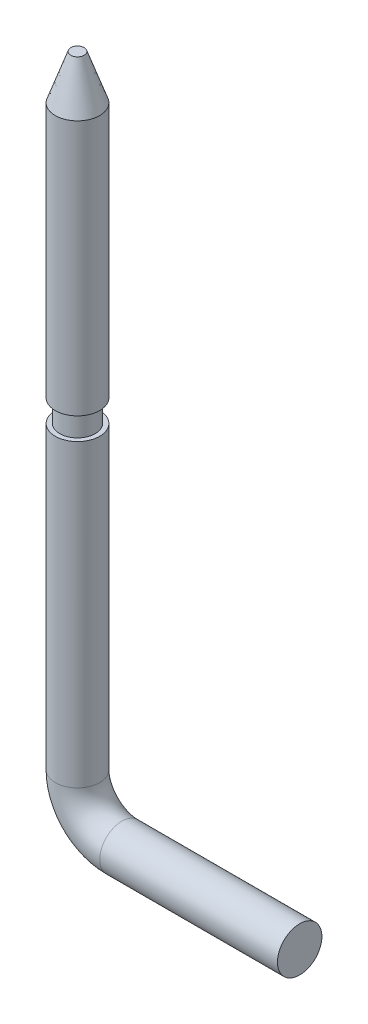
ISO-10303-21;
HEADER;
FILE_DESCRIPTION(('STEP AP214'),'2;1');
FILE_NAME('part.step','',(''),(''),'','','');
FILE_SCHEMA(('AUTOMOTIVE_DESIGN { 1 0 10303 214 1 1 1 1 }'));
ENDSEC;
DATA;
#1=APPLICATION_CONTEXT('core data for automotive mechanical design processes');
#2=APPLICATION_PROTOCOL_DEFINITION('international standard','automotive_design',2000,#1);
#3=PRODUCT_CONTEXT('',#1,'mechanical');
#4=PRODUCT('Part','Part','',(#3));
#5=PRODUCT_RELATED_PRODUCT_CATEGORY('part','',(#4));
#6=PRODUCT_DEFINITION_FORMATION('','',#4);
#7=PRODUCT_DEFINITION_CONTEXT('part definition',#1,'design');
#8=PRODUCT_DEFINITION('design','',#6,#7);
#9=PRODUCT_DEFINITION_SHAPE('','',#8);
#10=(LENGTH_UNIT() NAMED_UNIT(*) SI_UNIT(.MILLI.,.METRE.));
#11=(NAMED_UNIT(*) PLANE_ANGLE_UNIT() SI_UNIT($,.RADIAN.));
#12=(NAMED_UNIT(*) SI_UNIT($,.STERADIAN.) SOLID_ANGLE_UNIT());
#13=UNCERTAINTY_MEASURE_WITH_UNIT(LENGTH_MEASURE(1.E-05),#10,'distance_accuracy_value','');
#14=(GEOMETRIC_REPRESENTATION_CONTEXT(3) GLOBAL_UNCERTAINTY_ASSIGNED_CONTEXT((#13)) GLOBAL_UNIT_ASSIGNED_CONTEXT((#10,
#11,#12)) REPRESENTATION_CONTEXT('',''));
#15=CARTESIAN_POINT('',(0.,0.,0.));
#16=DIRECTION('',(0.,0.,1.));
#17=DIRECTION('',(1.,0.,0.));
#18=AXIS2_PLACEMENT_3D('',#15,#16,#17);
#19=CARTESIAN_POINT('',(0.,2.00000000000001,0.));
#20=DIRECTION('',(0.,1.,0.));
#21=DIRECTION('',(-1.,0.,0.));
#22=AXIS2_PLACEMENT_3D('',#19,#20,#21);
#23=CYLINDRICAL_SURFACE('',#22,1.);
#24=CARTESIAN_POINT('',(0.,15.5,0.));
#25=DIRECTION('',(0.,1.,0.));
#26=DIRECTION('',(0.,0.,1.));
#27=AXIS2_PLACEMENT_3D('',#24,#25,#26);
#28=CIRCLE('',#27,1.);
#29=CARTESIAN_POINT('',(0.,15.5,1.));
#30=VERTEX_POINT('',#29);
#31=EDGE_CURVE('E53',#30,#30,#28,.T.);
#32=ORIENTED_EDGE('',*,*,#31,.F.);
#33=EDGE_LOOP('',(#32));
#34=FACE_BOUND('',#33,.T.);
#35=CARTESIAN_POINT('',(0.,2.00000000000001,0.));
#36=DIRECTION('',(0.,-1.,0.));
#37=DIRECTION('',(0.,0.,-1.));
#38=AXIS2_PLACEMENT_3D('',#35,#36,#37);
#39=CIRCLE('',#38,1.);
#40=CARTESIAN_POINT('',(-1.,2.00000000000002,0.));
#41=VERTEX_POINT('',#40);
#42=EDGE_CURVE('E10',#41,#41,#39,.T.);
#43=ORIENTED_EDGE('',*,*,#42,.F.);
#44=EDGE_LOOP('',(#43));
#45=FACE_BOUND('',#44,.T.);
#46=ADVANCED_FACE('F30',(#34,#45),#23,.T.);
#47=CARTESIAN_POINT('',(2.,2.,0.));
#48=DIRECTION('',(0.,0.,-1.));
#49=DIRECTION('',(-1.,0.,0.));
#50=AXIS2_PLACEMENT_3D('',#47,#48,#49);
#51=TOROIDAL_SURFACE('',#50,2.,1.);
#52=CARTESIAN_POINT('',(2.00000000000001,0.,0.));
#53=DIRECTION('',(1.,0.,0.));
#54=DIRECTION('',(0.,0.,-1.));
#55=AXIS2_PLACEMENT_3D('',#52,#53,#54);
#56=CIRCLE('',#55,1.);
#57=CARTESIAN_POINT('',(2.00000000000002,-1.,0.));
#58=VERTEX_POINT('',#57);
#59=EDGE_CURVE('E37',#58,#58,#56,.T.);
#60=CARTESIAN_POINT('',(2.,2.,0.));
#61=DIRECTION('',(0.,0.,-1.));
#62=DIRECTION('',(-1.,0.,0.));
#63=AXIS2_PLACEMENT_3D('',#60,#61,#62);
#64=CIRCLE('',#63,3.);
#65=EDGE_CURVE('',#58,#41,#64,.T.);
#66=ORIENTED_EDGE('',*,*,#59,.F.);
#67=ORIENTED_EDGE('',*,*,#42,.T.);
#68=ORIENTED_EDGE('',*,*,#65,.T.);
#69=ORIENTED_EDGE('',*,*,#65,.F.);
#70=EDGE_LOOP('',(#66,#68,#67,#69));
#71=FACE_BOUND('',#70,.T.);
#72=ADVANCED_FACE('F90',(#71),#51,.T.);
#73=CARTESIAN_POINT('',(2.00000000000001,0.,0.));
#74=DIRECTION('',(1.,0.,0.));
#75=DIRECTION('',(0.,0.,-1.));
#76=AXIS2_PLACEMENT_3D('',#73,#74,#75);
#77=CYLINDRICAL_SURFACE('',#76,1.);
#78=ORIENTED_EDGE('',*,*,#59,.T.);
#79=EDGE_LOOP('',(#78));
#80=FACE_BOUND('',#79,.T.);
#81=CARTESIAN_POINT('',(10.,0.,0.));
#82=DIRECTION('',(1.,0.,0.));
#83=DIRECTION('',(0.,0.,-1.));
#84=AXIS2_PLACEMENT_3D('',#81,#82,#83);
#85=CIRCLE('',#84,1.);
#86=CARTESIAN_POINT('',(10.,0.,-1.));
#87=VERTEX_POINT('',#86);
#88=EDGE_CURVE('E41',#87,#87,#85,.T.);
#89=ORIENTED_EDGE('',*,*,#88,.F.);
#90=EDGE_LOOP('',(#89));
#91=FACE_BOUND('',#90,.T.);
#92=ADVANCED_FACE('F94',(#80,#91),#77,.T.);
#93=CARTESIAN_POINT('',(10.,0.,0.));
#94=DIRECTION('',(1.,0.,0.));
#95=DIRECTION('',(0.,0.,-1.));
#96=AXIS2_PLACEMENT_3D('',#93,#94,#95);
#97=PLANE('',#96);
#98=ORIENTED_EDGE('',*,*,#88,.T.);
#99=EDGE_LOOP('',(#98));
#100=FACE_BOUND('',#99,.T.);
#101=ADVANCED_FACE('F84',(#100),#97,.T.);
#102=CARTESIAN_POINT('',(-1.,15.5,0.));
#103=DIRECTION('',(0.,-1.,0.));
#104=DIRECTION('',(0.,0.,-1.));
#105=AXIS2_PLACEMENT_3D('',#102,#103,#104);
#106=PLANE('',#105);
#107=CARTESIAN_POINT('',(0.,15.5,0.));
#108=DIRECTION('',(0.,1.,0.));
#109=DIRECTION('',(0.,0.,1.));
#110=AXIS2_PLACEMENT_3D('',#107,#108,#109);
#111=CIRCLE('',#110,0.8);
#112=CARTESIAN_POINT('',(0.,15.5,0.8));
#113=VERTEX_POINT('',#112);
#114=EDGE_CURVE('E56',#113,#113,#111,.T.);
#115=ORIENTED_EDGE('',*,*,#114,.F.);
#116=EDGE_LOOP('',(#115));
#117=FACE_BOUND('',#116,.T.);
#118=ORIENTED_EDGE('',*,*,#31,.T.);
#119=EDGE_LOOP('',(#118));
#120=FACE_BOUND('',#119,.T.);
#121=ADVANCED_FACE('F78',(#117,#120),#106,.F.);
#122=CARTESIAN_POINT('',(0.,30.,0.));
#123=DIRECTION('',(0.,1.,0.));
#124=DIRECTION('',(0.,0.,1.));
#125=AXIS2_PLACEMENT_3D('',#122,#123,#124);
#126=CYLINDRICAL_SURFACE('',#125,0.8);
#127=CARTESIAN_POINT('',(0.,16.5,0.));
#128=DIRECTION('',(0.,1.,0.));
#129=DIRECTION('',(0.,0.,1.));
#130=AXIS2_PLACEMENT_3D('',#127,#128,#129);
#131=CIRCLE('',#130,0.8);
#132=CARTESIAN_POINT('',(0.,16.5,0.8));
#133=VERTEX_POINT('',#132);
#134=EDGE_CURVE('E59',#133,#133,#131,.T.);
#135=ORIENTED_EDGE('',*,*,#134,.F.);
#136=EDGE_LOOP('',(#135));
#137=FACE_BOUND('',#136,.T.);
#138=ORIENTED_EDGE('',*,*,#114,.T.);
#139=EDGE_LOOP('',(#138));
#140=FACE_BOUND('',#139,.T.);
#141=ADVANCED_FACE('F72',(#137,#140),#126,.T.);
#142=CARTESIAN_POINT('',(-1.,16.5,0.));
#143=DIRECTION('',(0.,1.,0.));
#144=DIRECTION('',(0.,0.,1.));
#145=AXIS2_PLACEMENT_3D('',#142,#143,#144);
#146=PLANE('',#145);
#147=CARTESIAN_POINT('',(0.,16.5,0.));
#148=DIRECTION('',(0.,1.,0.));
#149=DIRECTION('',(0.,0.,1.));
#150=AXIS2_PLACEMENT_3D('',#147,#148,#149);
#151=CIRCLE('',#150,1.);
#152=CARTESIAN_POINT('',(0.,16.5,1.));
#153=VERTEX_POINT('',#152);
#154=EDGE_CURVE('E62',#153,#153,#151,.T.);
#155=ORIENTED_EDGE('',*,*,#154,.F.);
#156=EDGE_LOOP('',(#155));
#157=FACE_BOUND('',#156,.T.);
#158=ORIENTED_EDGE('',*,*,#134,.T.);
#159=EDGE_LOOP('',(#158));
#160=FACE_BOUND('',#159,.T.);
#161=ADVANCED_FACE('F68',(#157,#160),#146,.F.);
#162=CARTESIAN_POINT('',(0.,30.,0.));
#163=DIRECTION('',(0.,-1.,0.));
#164=DIRECTION('',(0.,0.,-1.));
#165=AXIS2_PLACEMENT_3D('',#162,#163,#164);
#166=PLANE('',#165);
#167=CARTESIAN_POINT('',(0.,30.,0.));
#168=DIRECTION('',(0.,1.,0.));
#169=DIRECTION('',(0.,0.,1.));
#170=AXIS2_PLACEMENT_3D('',#167,#168,#169);
#171=CIRCLE('',#170,0.3);
#172=CARTESIAN_POINT('',(0.,30.,0.3));
#173=VERTEX_POINT('',#172);
#174=EDGE_CURVE('E50',#173,#173,#171,.T.);
#175=ORIENTED_EDGE('',*,*,#174,.T.);
#176=EDGE_LOOP('',(#175));
#177=FACE_BOUND('',#176,.T.);
#178=ADVANCED_FACE('F71',(#177),#166,.F.);
#179=CARTESIAN_POINT('',(0.,28.,0.));
#180=DIRECTION('',(0.,-1.,0.));
#181=DIRECTION('',(0.,0.,-1.));
#182=AXIS2_PLACEMENT_3D('',#179,#180,#181);
#183=CONICAL_SURFACE('',#182,1.,0.336674819386727);
#184=ORIENTED_EDGE('',*,*,#174,.F.);
#185=EDGE_LOOP('',(#184));
#186=FACE_BOUND('',#185,.T.);
#187=CARTESIAN_POINT('',(0.,28.,0.));
#188=DIRECTION('',(0.,1.,0.));
#189=DIRECTION('',(0.,0.,1.));
#190=AXIS2_PLACEMENT_3D('',#187,#188,#189);
#191=CIRCLE('',#190,1.);
#192=CARTESIAN_POINT('',(0.,28.,1.));
#193=VERTEX_POINT('',#192);
#194=EDGE_CURVE('E46',#193,#193,#191,.T.);
#195=ORIENTED_EDGE('',*,*,#194,.T.);
#196=EDGE_LOOP('',(#195));
#197=FACE_BOUND('',#196,.T.);
#198=ADVANCED_FACE('F97',(#186,#197),#183,.T.);
#199=ORIENTED_EDGE('',*,*,#154,.T.);
#200=EDGE_LOOP('',(#199));
#201=FACE_BOUND('',#200,.T.);
#202=ORIENTED_EDGE('',*,*,#194,.F.);
#203=EDGE_LOOP('',(#202));
#204=FACE_BOUND('',#203,.T.);
#205=ADVANCED_FACE('F32',(#201,#204),#23,.T.);
#206=CLOSED_SHELL('',(#46,#72,#92,#101,#121,#141,#161,#178,#198,#205));
#207=MANIFOLD_SOLID_BREP('B2',#206);
#208=ADVANCED_BREP_SHAPE_REPRESENTATION('',(#18,#207),#14);
#209=SHAPE_DEFINITION_REPRESENTATION(#9,#208);
ENDSEC;
END-ISO-10303-21;
